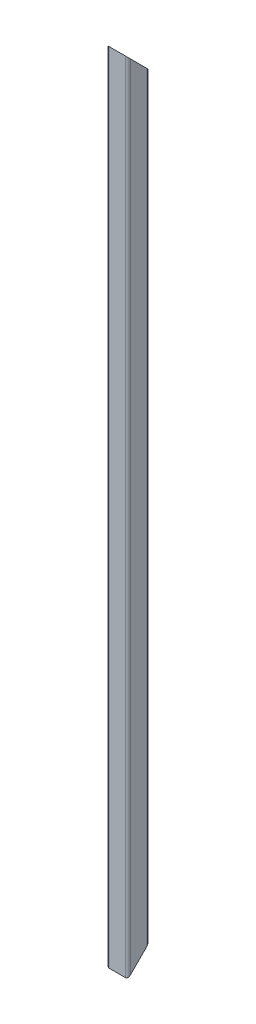
ISO-10303-21;
HEADER;
FILE_DESCRIPTION(('STEP AP214'),'2;1');
FILE_NAME('part.step','',(''),(''),'','','');
FILE_SCHEMA(('AUTOMOTIVE_DESIGN { 1 0 10303 214 1 1 1 1 }'));
ENDSEC;
DATA;
#1=APPLICATION_CONTEXT('core data for automotive mechanical design processes');
#2=APPLICATION_PROTOCOL_DEFINITION('international standard','automotive_design',2000,#1);
#3=PRODUCT_CONTEXT('',#1,'mechanical');
#4=PRODUCT('Part','Part','',(#3));
#5=PRODUCT_RELATED_PRODUCT_CATEGORY('part','',(#4));
#6=PRODUCT_DEFINITION_FORMATION('','',#4);
#7=PRODUCT_DEFINITION_CONTEXT('part definition',#1,'design');
#8=PRODUCT_DEFINITION('design','',#6,#7);
#9=PRODUCT_DEFINITION_SHAPE('','',#8);
#10=(LENGTH_UNIT() NAMED_UNIT(*) SI_UNIT(.MILLI.,.METRE.));
#11=(NAMED_UNIT(*) PLANE_ANGLE_UNIT() SI_UNIT($,.RADIAN.));
#12=(NAMED_UNIT(*) SI_UNIT($,.STERADIAN.) SOLID_ANGLE_UNIT());
#13=UNCERTAINTY_MEASURE_WITH_UNIT(LENGTH_MEASURE(1.E-05),#10,'distance_accuracy_value','');
#14=(GEOMETRIC_REPRESENTATION_CONTEXT(3) GLOBAL_UNCERTAINTY_ASSIGNED_CONTEXT((#13)) GLOBAL_UNIT_ASSIGNED_CONTEXT((#10,
#11,#12)) REPRESENTATION_CONTEXT('',''));
#15=CARTESIAN_POINT('',(0.,0.,0.));
#16=DIRECTION('',(0.,0.,1.));
#17=DIRECTION('',(1.,0.,0.));
#18=AXIS2_PLACEMENT_3D('',#15,#16,#17);
#19=CARTESIAN_POINT('',(-15.5000000000005,1460.,-20.0000000000038));
#20=DIRECTION('',(0.,0.,0.999999999999995));
#21=DIRECTION('',(0.999999999999986,0.,0.));
#22=AXIS2_PLACEMENT_3D('',#19,#20,#21);
#23=PLANE('',#22);
#24=DIRECTION('',(0.999999999999986,0.,0.));
#25=VECTOR('',#24,1.);
#26=CARTESIAN_POINT('',(-15.4999999999985,20.0000000000002,-20.0000000000025));
#27=LINE('',#26,#25);
#28=CARTESIAN_POINT('',(-15.4999999999985,20.0000000000002,-20.0000000000025));
#29=VERTEX_POINT('',#28);
#30=CARTESIAN_POINT('',(15.5000000000012,19.9999999999982,-20.0000000000026));
#31=VERTEX_POINT('',#30);
#32=EDGE_CURVE('E269',#29,#31,#27,.T.);
#33=ORIENTED_EDGE('',*,*,#32,.F.);
#34=DIRECTION('',(0.,-0.999999999999997,0.));
#35=VECTOR('',#34,1.);
#36=CARTESIAN_POINT('',(-15.5000000000005,1460.,-20.0000000000038));
#37=LINE('',#36,#35);
#38=CARTESIAN_POINT('',(-15.4999999999981,1440.,-20.0000000000026));
#39=VERTEX_POINT('',#38);
#40=EDGE_CURVE('E233',#39,#29,#37,.T.);
#41=ORIENTED_EDGE('',*,*,#40,.F.);
#42=DIRECTION('',(-0.999999999999986,0.,0.));
#43=VECTOR('',#42,1.);
#44=CARTESIAN_POINT('',(-15.4999999999981,1440.,-20.0000000000026));
#45=LINE('',#44,#43);
#46=CARTESIAN_POINT('',(15.5000000000012,1439.99999999999,-20.0000000000001));
#47=VERTEX_POINT('',#46);
#48=EDGE_CURVE('E333',#47,#39,#45,.T.);
#49=ORIENTED_EDGE('',*,*,#48,.F.);
#50=DIRECTION('',(0.,-0.999999999999997,0.));
#51=VECTOR('',#50,1.);
#52=CARTESIAN_POINT('',(15.4999999999996,1459.99999999999,-20.0000000000016));
#53=LINE('',#52,#51);
#54=EDGE_CURVE('E236',#47,#31,#53,.T.);
#55=ORIENTED_EDGE('',*,*,#54,.T.);
#56=EDGE_LOOP('',(#33,#41,#49,#55));
#57=FACE_BOUND('',#56,.T.);
#58=ADVANCED_FACE('F47',(#57),#23,.F.);
#59=CARTESIAN_POINT('',(-2.22044604925031E-13,1459.99999999999,-2.60902410786912E-12));
#60=DIRECTION('',(0.,0.707106781186544,-0.707106781186545));
#61=DIRECTION('',(0.,0.707106781186544,0.707106781186544));
#62=AXIS2_PLACEMENT_3D('',#59,#60,#61);
#63=PLANE('',#62);
#64=CARTESIAN_POINT('',(-14.9999999999966,1444.99999999999,-15.0000000000016));
#65=DIRECTION('',(0.,0.707106781186544,-0.707106781186545));
#66=DIRECTION('',(0.,-0.707106781186544,-0.707106781186544));
#67=AXIS2_PLACEMENT_3D('',#64,#65,#66);
#68=ELLIPSE('',#67,4.24264068711928,3.);
#69=CARTESIAN_POINT('',(-14.9999999999986,1441.99999999999,-18.0000000000016));
#70=VERTEX_POINT('',#69);
#71=CARTESIAN_POINT('',(-17.9999999999985,1444.99999999999,-15.000000000002));
#72=VERTEX_POINT('',#71);
#73=EDGE_CURVE('E196',#70,#72,#68,.T.);
#74=ORIENTED_EDGE('',*,*,#73,.F.);
#75=DIRECTION('',(-0.999999999999986,0.,0.));
#76=VECTOR('',#75,1.);
#77=CARTESIAN_POINT('',(-14.9999999999986,1441.99999999999,-18.0000000000016));
#78=LINE('',#77,#76);
#79=CARTESIAN_POINT('',(15.000000000001,1441.99999999999,-18.0000000000009));
#80=VERTEX_POINT('',#79);
#81=EDGE_CURVE('E327',#80,#70,#78,.T.);
#82=ORIENTED_EDGE('',*,*,#81,.F.);
#83=CARTESIAN_POINT('',(15.0000000000028,1444.99999999999,-15.0000000000025));
#84=DIRECTION('',(0.,0.707106781186544,-0.707106781186545));
#85=DIRECTION('',(0.,-0.707106781186544,-0.707106781186544));
#86=AXIS2_PLACEMENT_3D('',#83,#84,#85);
#87=ELLIPSE('',#86,4.24264068711928,3.);
#88=CARTESIAN_POINT('',(18.0000000000037,1444.99999999999,-15.0000000000031));
#89=VERTEX_POINT('',#88);
#90=EDGE_CURVE('E323',#89,#80,#87,.T.);
#91=ORIENTED_EDGE('',*,*,#90,.F.);
#92=DIRECTION('',(0.,-0.707106781186544,-0.707106781186544));
#93=VECTOR('',#92,1.);
#94=CARTESIAN_POINT('',(18.0000000000025,1452.49999999999,-7.50000000000267));
#95=LINE('',#94,#93);
#96=CARTESIAN_POINT('',(18.,1474.99999999999,14.9999999999971));
#97=VERTEX_POINT('',#96);
#98=EDGE_CURVE('E319',#97,#89,#95,.T.);
#99=ORIENTED_EDGE('',*,*,#98,.F.);
#100=CARTESIAN_POINT('',(15.0000000000015,1474.99999999999,14.9999999999973));
#101=DIRECTION('',(0.,0.707106781186544,-0.707106781186545));
#102=DIRECTION('',(0.,-0.707106781186544,-0.707106781186544));
#103=AXIS2_PLACEMENT_3D('',#100,#101,#102);
#104=ELLIPSE('',#103,4.24264068711928,3.);
#105=CARTESIAN_POINT('',(14.999999999999,1477.99999999999,17.9999999999985));
#106=VERTEX_POINT('',#105);
#107=EDGE_CURVE('E315',#106,#97,#104,.T.);
#108=ORIENTED_EDGE('',*,*,#107,.F.);
#109=DIRECTION('',(0.999999999999986,0.,0.));
#110=VECTOR('',#109,1.);
#111=CARTESIAN_POINT('',(-14.9999999999984,1477.99999999999,17.9999999999977));
#112=LINE('',#111,#110);
#113=CARTESIAN_POINT('',(-14.9999999999984,1477.99999999999,17.9999999999977));
#114=VERTEX_POINT('',#113);
#115=EDGE_CURVE('E265',#114,#106,#112,.T.);
#116=ORIENTED_EDGE('',*,*,#115,.F.);
#117=CARTESIAN_POINT('',(-14.999999999999,1474.99999999999,14.9999999999992));
#118=DIRECTION('',(0.,0.707106781186544,-0.707106781186545));
#119=DIRECTION('',(0.,-0.707106781186544,-0.707106781186544));
#120=AXIS2_PLACEMENT_3D('',#117,#118,#119);
#121=ELLIPSE('',#120,4.24264068711928,3.);
#122=CARTESIAN_POINT('',(-17.9999999999973,1474.99999999999,14.9999999999968));
#123=VERTEX_POINT('',#122);
#124=EDGE_CURVE('E263',#123,#114,#121,.T.);
#125=ORIENTED_EDGE('',*,*,#124,.F.);
#126=DIRECTION('',(0.,0.707106781186544,0.707106781186544));
#127=VECTOR('',#126,1.);
#128=CARTESIAN_POINT('',(-17.9999999999977,1452.49999999999,-7.50000000000245));
#129=LINE('',#128,#127);
#130=EDGE_CURVE('E56',#72,#123,#129,.T.);
#131=ORIENTED_EDGE('',*,*,#130,.F.);
#132=EDGE_LOOP('',(#74,#82,#91,#99,#108,#116,#125,#131));
#133=FACE_BOUND('',#132,.T.);
#134=ORIENTED_EDGE('',*,*,#48,.T.);
#135=CARTESIAN_POINT('',(-15.4999999999965,1444.5,-15.5000000000037));
#136=DIRECTION('',(0.,0.707106781186544,-0.707106781186545));
#137=DIRECTION('',(0.,-0.707106781186544,-0.707106781186544));
#138=AXIS2_PLACEMENT_3D('',#135,#136,#137);
#139=ELLIPSE('',#138,6.36396103067893,4.5);
#140=CARTESIAN_POINT('',(-19.9999999999978,1444.5,-15.5000000000011));
#141=VERTEX_POINT('',#140);
#142=EDGE_CURVE('E208',#39,#141,#139,.T.);
#143=ORIENTED_EDGE('',*,*,#142,.T.);
#144=DIRECTION('',(0.,0.707106781186544,0.707106781186544));
#145=VECTOR('',#144,1.);
#146=CARTESIAN_POINT('',(-19.9999999999987,1452.24999999999,-7.75000000000353));
#147=LINE('',#146,#145);
#148=CARTESIAN_POINT('',(-19.9999999999994,1475.49999999999,15.5000000000001));
#149=VERTEX_POINT('',#148);
#150=EDGE_CURVE('E356',#141,#149,#147,.T.);
#151=ORIENTED_EDGE('',*,*,#150,.T.);
#152=CARTESIAN_POINT('',(-15.5000000000005,1475.49999999999,15.4999999999985));
#153=DIRECTION('',(0.,0.707106781186544,-0.707106781186545));
#154=DIRECTION('',(0.,-0.707106781186544,-0.707106781186544));
#155=AXIS2_PLACEMENT_3D('',#152,#153,#154);
#156=ELLIPSE('',#155,6.36396103067893,4.5);
#157=CARTESIAN_POINT('',(-15.5000000000014,1479.99999999999,19.9999999999972));
#158=VERTEX_POINT('',#157);
#159=EDGE_CURVE('E353',#149,#158,#156,.T.);
#160=ORIENTED_EDGE('',*,*,#159,.T.);
#161=DIRECTION('',(0.999999999999986,0.,0.));
#162=VECTOR('',#161,1.);
#163=CARTESIAN_POINT('',(-15.5000000000014,1479.99999999999,19.9999999999972));
#164=LINE('',#163,#162);
#165=CARTESIAN_POINT('',(15.5000000000009,1479.99999999999,19.9999999999975));
#166=VERTEX_POINT('',#165);
#167=EDGE_CURVE('E349',#158,#166,#164,.T.);
#168=ORIENTED_EDGE('',*,*,#167,.T.);
#169=CARTESIAN_POINT('',(15.4999999999987,1475.49999999999,15.4999999999978));
#170=DIRECTION('',(0.,0.707106781186544,-0.707106781186545));
#171=DIRECTION('',(0.,-0.707106781186544,-0.707106781186544));
#172=AXIS2_PLACEMENT_3D('',#169,#170,#171);
#173=ELLIPSE('',#172,6.36396103067893,4.5);
#174=CARTESIAN_POINT('',(19.9999999999985,1475.49999999999,15.4999999999988));
#175=VERTEX_POINT('',#174);
#176=EDGE_CURVE('E345',#166,#175,#173,.T.);
#177=ORIENTED_EDGE('',*,*,#176,.T.);
#178=DIRECTION('',(0.,-0.707106781186544,-0.707106781186544));
#179=VECTOR('',#178,1.);
#180=CARTESIAN_POINT('',(20.0000000000013,1452.24999999999,-7.75000000000342));
#181=LINE('',#180,#179);
#182=CARTESIAN_POINT('',(20.0000000000022,1444.49999999999,-15.5000000000033));
#183=VERTEX_POINT('',#182);
#184=EDGE_CURVE('E341',#175,#183,#181,.T.);
#185=ORIENTED_EDGE('',*,*,#184,.T.);
#186=CARTESIAN_POINT('',(15.500000000003,1444.49999999999,-15.5000000000024));
#187=DIRECTION('',(0.,0.707106781186544,-0.707106781186545));
#188=DIRECTION('',(0.,-0.707106781186544,-0.707106781186544));
#189=AXIS2_PLACEMENT_3D('',#186,#187,#188);
#190=ELLIPSE('',#189,6.36396103067893,4.5);
#191=EDGE_CURVE('E337',#183,#47,#190,.T.);
#192=ORIENTED_EDGE('',*,*,#191,.T.);
#193=EDGE_LOOP('',(#134,#143,#151,#160,#168,#177,#185,#192));
#194=FACE_BOUND('',#193,.T.);
#195=ADVANCED_FACE('F260',(#133,#194),#63,.T.);
#196=CARTESIAN_POINT('',(-20.0000000000012,1460.,-15.5000000000036));
#197=DIRECTION('',(0.999999999999986,0.,0.));
#198=DIRECTION('',(0.,0.,-0.999999999999995));
#199=AXIS2_PLACEMENT_3D('',#196,#197,#198);
#200=PLANE('',#199);
#201=DIRECTION('',(0.,0.707106781186544,-0.707106781186545));
#202=VECTOR('',#201,1.);
#203=CARTESIAN_POINT('',(-19.9999999999983,737.749999999997,-737.749999999998));
#204=LINE('',#203,#202);
#205=CARTESIAN_POINT('',(-19.9999999999983,-15.4999999999982,15.4999999999989));
#206=VERTEX_POINT('',#205);
#207=CARTESIAN_POINT('',(-19.9999999999987,15.5000000000015,-15.5000000000027));
#208=VERTEX_POINT('',#207);
#209=EDGE_CURVE('E286',#206,#208,#204,.T.);
#210=ORIENTED_EDGE('',*,*,#209,.F.);
#211=DIRECTION('',(0.,-0.999999999999997,0.));
#212=VECTOR('',#211,1.);
#213=CARTESIAN_POINT('',(-20.0000000000003,1459.99999999999,15.4999999999961));
#214=LINE('',#213,#212);
#215=EDGE_CURVE('E205',#149,#206,#214,.T.);
#216=ORIENTED_EDGE('',*,*,#215,.F.);
#217=ORIENTED_EDGE('',*,*,#150,.F.);
#218=DIRECTION('',(0.,-0.999999999999997,0.));
#219=VECTOR('',#218,1.);
#220=CARTESIAN_POINT('',(-20.0000000000012,1460.,-15.5000000000036));
#221=LINE('',#220,#219);
#222=EDGE_CURVE('E66',#141,#208,#221,.T.);
#223=ORIENTED_EDGE('',*,*,#222,.T.);
#224=EDGE_LOOP('',(#210,#216,#217,#223));
#225=FACE_BOUND('',#224,.T.);
#226=ADVANCED_FACE('F368',(#225),#200,.F.);
#227=CARTESIAN_POINT('',(-15.5000000000003,1459.99999999999,15.4999999999961));
#228=DIRECTION('',(0.,-0.999999999999997,0.));
#229=DIRECTION('',(0.,0.,-0.999999999999995));
#230=AXIS2_PLACEMENT_3D('',#227,#228,#229);
#231=CYLINDRICAL_SURFACE('',#230,4.5);
#232=CARTESIAN_POINT('',(-15.5000000000003,-15.4999999999986,15.499999999997));
#233=DIRECTION('',(0.,-0.707106781186544,-0.707106781186545));
#234=DIRECTION('',(0.,-0.707106781186544,0.707106781186545));
#235=AXIS2_PLACEMENT_3D('',#232,#233,#234);
#236=ELLIPSE('',#235,6.36396103067893,4.5);
#237=CARTESIAN_POINT('',(-15.5000000000003,-20.,19.9999999999962));
#238=VERTEX_POINT('',#237);
#239=EDGE_CURVE('E290',#238,#206,#236,.T.);
#240=ORIENTED_EDGE('',*,*,#239,.F.);
#241=DIRECTION('',(0.,-0.999999999999997,0.));
#242=VECTOR('',#241,1.);
#243=CARTESIAN_POINT('',(-15.5000000000003,1459.99999999999,19.9999999999959));
#244=LINE('',#243,#242);
#245=EDGE_CURVE('E251',#158,#238,#244,.T.);
#246=ORIENTED_EDGE('',*,*,#245,.F.);
#247=ORIENTED_EDGE('',*,*,#159,.F.);
#248=ORIENTED_EDGE('',*,*,#215,.T.);
#249=EDGE_LOOP('',(#240,#246,#247,#248));
#250=FACE_BOUND('',#249,.T.);
#251=ADVANCED_FACE('F370',(#250),#231,.T.);
#252=CARTESIAN_POINT('',(-15.5000000000003,1459.99999999999,19.9999999999959));
#253=DIRECTION('',(0.,0.,-0.999999999999995));
#254=DIRECTION('',(-0.999999999999986,0.,0.));
#255=AXIS2_PLACEMENT_3D('',#252,#253,#254);
#256=PLANE('',#255);
#257=DIRECTION('',(-0.999999999999986,0.,0.));
#258=VECTOR('',#257,1.);
#259=CARTESIAN_POINT('',(-15.5000000000003,-20.,19.9999999999962));
#260=LINE('',#259,#258);
#261=CARTESIAN_POINT('',(15.5000000000003,-20.0000000000002,19.9999999999961));
#262=VERTEX_POINT('',#261);
#263=EDGE_CURVE('E294',#262,#238,#260,.T.);
#264=ORIENTED_EDGE('',*,*,#263,.F.);
#265=DIRECTION('',(0.,-0.999999999999997,0.));
#266=VECTOR('',#265,1.);
#267=CARTESIAN_POINT('',(15.4999999999996,1459.99999999999,19.9999999999965));
#268=LINE('',#267,#266);
#269=EDGE_CURVE('E247',#166,#262,#268,.T.);
#270=ORIENTED_EDGE('',*,*,#269,.F.);
#271=ORIENTED_EDGE('',*,*,#167,.F.);
#272=ORIENTED_EDGE('',*,*,#245,.T.);
#273=EDGE_LOOP('',(#264,#270,#271,#272));
#274=FACE_BOUND('',#273,.T.);
#275=ADVANCED_FACE('F374',(#274),#256,.F.);
#276=CARTESIAN_POINT('',(15.4999999999978,1459.99999999999,15.4999999999949));
#277=DIRECTION('',(0.,-0.999999999999997,0.));
#278=DIRECTION('',(0.,0.,-0.999999999999995));
#279=AXIS2_PLACEMENT_3D('',#276,#277,#278);
#280=CYLINDRICAL_SURFACE('',#279,4.5);
#281=CARTESIAN_POINT('',(15.5,-15.5000000000017,15.4999999999981));
#282=DIRECTION('',(0.,-0.707106781186544,-0.707106781186545));
#283=DIRECTION('',(0.,-0.707106781186544,0.707106781186545));
#284=AXIS2_PLACEMENT_3D('',#281,#282,#283);
#285=ELLIPSE('',#284,6.36396103067893,4.5);
#286=CARTESIAN_POINT('',(20.,-15.5000000000017,15.4999999999983));
#287=VERTEX_POINT('',#286);
#288=EDGE_CURVE('E298',#287,#262,#285,.T.);
#289=ORIENTED_EDGE('',*,*,#288,.F.);
#290=DIRECTION('',(0.,-0.999999999999997,0.));
#291=VECTOR('',#290,1.);
#292=CARTESIAN_POINT('',(19.9999999999986,1459.99999999999,15.499999999998));
#293=LINE('',#292,#291);
#294=EDGE_CURVE('E243',#175,#287,#293,.T.);
#295=ORIENTED_EDGE('',*,*,#294,.F.);
#296=ORIENTED_EDGE('',*,*,#176,.F.);
#297=ORIENTED_EDGE('',*,*,#269,.T.);
#298=EDGE_LOOP('',(#289,#295,#296,#297));
#299=FACE_BOUND('',#298,.T.);
#300=ADVANCED_FACE('F376',(#299),#280,.T.);
#301=CARTESIAN_POINT('',(20.,1459.99999999999,-15.5000000000031));
#302=DIRECTION('',(-0.999999999999986,0.,0.));
#303=DIRECTION('',(0.,0.,0.999999999999995));
#304=AXIS2_PLACEMENT_3D('',#301,#302,#303);
#305=PLANE('',#304);
#306=DIRECTION('',(0.,-0.707106781186544,0.707106781186545));
#307=VECTOR('',#306,1.);
#308=CARTESIAN_POINT('',(20.0000000000017,737.749999999997,-737.75));
#309=LINE('',#308,#307);
#310=CARTESIAN_POINT('',(20.0000000000018,15.4999999999986,-15.500000000003));
#311=VERTEX_POINT('',#310);
#312=EDGE_CURVE('E302',#311,#287,#309,.T.);
#313=ORIENTED_EDGE('',*,*,#312,.F.);
#314=DIRECTION('',(0.,-0.999999999999997,0.));
#315=VECTOR('',#314,1.);
#316=CARTESIAN_POINT('',(20.,1459.99999999999,-15.5000000000031));
#317=LINE('',#316,#315);
#318=EDGE_CURVE('E239',#183,#311,#317,.T.);
#319=ORIENTED_EDGE('',*,*,#318,.F.);
#320=ORIENTED_EDGE('',*,*,#184,.F.);
#321=ORIENTED_EDGE('',*,*,#294,.T.);
#322=EDGE_LOOP('',(#313,#319,#320,#321));
#323=FACE_BOUND('',#322,.T.);
#324=ADVANCED_FACE('F381',(#323),#305,.F.);
#325=CARTESIAN_POINT('',(15.4999999999994,1459.99999999999,-15.5000000000033));
#326=DIRECTION('',(0.,-0.999999999999997,0.));
#327=DIRECTION('',(0.,0.,-0.999999999999995));
#328=AXIS2_PLACEMENT_3D('',#325,#326,#327);
#329=CYLINDRICAL_SURFACE('',#328,4.5);
#330=CARTESIAN_POINT('',(15.5000000000007,15.4999999999984,-15.5000000000036));
#331=DIRECTION('',(0.,-0.707106781186544,-0.707106781186545));
#332=DIRECTION('',(0.,-0.707106781186544,0.707106781186545));
#333=AXIS2_PLACEMENT_3D('',#330,#331,#332);
#334=ELLIPSE('',#333,6.36396103067893,4.5);
#335=EDGE_CURVE('E306',#31,#311,#334,.T.);
#336=ORIENTED_EDGE('',*,*,#335,.F.);
#337=ORIENTED_EDGE('',*,*,#54,.F.);
#338=ORIENTED_EDGE('',*,*,#191,.F.);
#339=ORIENTED_EDGE('',*,*,#318,.T.);
#340=EDGE_LOOP('',(#336,#337,#338,#339));
#341=FACE_BOUND('',#340,.T.);
#342=ADVANCED_FACE('F383',(#341),#329,.T.);
#343=CARTESIAN_POINT('',(-15.4999999999998,1460.,-15.5000000000045));
#344=DIRECTION('',(0.,-0.999999999999997,0.));
#345=DIRECTION('',(0.,0.,-0.999999999999995));
#346=AXIS2_PLACEMENT_3D('',#343,#344,#345);
#347=CYLINDRICAL_SURFACE('',#346,4.5);
#348=CARTESIAN_POINT('',(-15.4999999999992,15.5000000000015,-15.5000000000019));
#349=DIRECTION('',(0.,-0.707106781186544,-0.707106781186545));
#350=DIRECTION('',(0.,-0.707106781186544,0.707106781186545));
#351=AXIS2_PLACEMENT_3D('',#348,#349,#350);
#352=ELLIPSE('',#351,6.36396103067893,4.5);
#353=EDGE_CURVE('E191',#208,#29,#352,.T.);
#354=ORIENTED_EDGE('',*,*,#353,.F.);
#355=ORIENTED_EDGE('',*,*,#222,.F.);
#356=ORIENTED_EDGE('',*,*,#142,.F.);
#357=ORIENTED_EDGE('',*,*,#40,.T.);
#358=EDGE_LOOP('',(#354,#355,#356,#357));
#359=FACE_BOUND('',#358,.T.);
#360=ADVANCED_FACE('F49',(#359),#347,.T.);
#361=CARTESIAN_POINT('',(-15.0000000000008,1459.99999999999,-15.0000000000045));
#362=DIRECTION('',(0.,-0.999999999999997,0.));
#363=DIRECTION('',(0.,0.,-0.999999999999995));
#364=AXIS2_PLACEMENT_3D('',#361,#362,#363);
#365=CYLINDRICAL_SURFACE('',#364,3.);
#366=DIRECTION('',(0.,-0.999999999999997,0.));
#367=VECTOR('',#366,1.);
#368=CARTESIAN_POINT('',(-18.0000000000003,1459.99999999999,-15.000000000003));
#369=LINE('',#368,#367);
#370=CARTESIAN_POINT('',(-17.9999999999993,15.0000000000001,-15.0000000000036));
#371=VERTEX_POINT('',#370);
#372=EDGE_CURVE('E186',#72,#371,#369,.T.);
#373=ORIENTED_EDGE('',*,*,#372,.T.);
#374=CARTESIAN_POINT('',(-14.9999999999997,14.9999999999995,-15.000000000002));
#375=DIRECTION('',(0.,-0.707106781186544,-0.707106781186545));
#376=DIRECTION('',(0.,-0.707106781186544,0.707106781186545));
#377=AXIS2_PLACEMENT_3D('',#374,#375,#376);
#378=ELLIPSE('',#377,4.24264068711928,3.);
#379=CARTESIAN_POINT('',(-14.9999999999997,18.000000000001,-18.0000000000015));
#380=VERTEX_POINT('',#379);
#381=EDGE_CURVE('E11',#371,#380,#378,.T.);
#382=ORIENTED_EDGE('',*,*,#381,.T.);
#383=DIRECTION('',(0.,-0.999999999999997,0.));
#384=VECTOR('',#383,1.);
#385=CARTESIAN_POINT('',(-15.0000000000003,1459.99999999999,-18.0000000000041));
#386=LINE('',#385,#384);
#387=EDGE_CURVE('E230',#70,#380,#386,.T.);
#388=ORIENTED_EDGE('',*,*,#387,.F.);
#389=ORIENTED_EDGE('',*,*,#73,.T.);
#390=EDGE_LOOP('',(#373,#382,#388,#389));
#391=FACE_BOUND('',#390,.T.);
#392=ADVANCED_FACE('F195',(#391),#365,.F.);
#393=CARTESIAN_POINT('',(-15.0000000000003,1459.99999999999,-18.0000000000041));
#394=DIRECTION('',(0.,0.,0.999999999999995));
#395=DIRECTION('',(0.999999999999986,0.,0.));
#396=AXIS2_PLACEMENT_3D('',#393,#394,#395);
#397=PLANE('',#396);
#398=ORIENTED_EDGE('',*,*,#387,.T.);
#399=DIRECTION('',(0.999999999999986,0.,0.));
#400=VECTOR('',#399,1.);
#401=CARTESIAN_POINT('',(-14.9999999999997,18.000000000001,-18.0000000000015));
#402=LINE('',#401,#400);
#403=CARTESIAN_POINT('',(14.9999999999997,18.0000000000002,-18.0000000000031));
#404=VERTEX_POINT('',#403);
#405=EDGE_CURVE('E75',#380,#404,#402,.T.);
#406=ORIENTED_EDGE('',*,*,#405,.T.);
#407=DIRECTION('',(0.,-0.999999999999997,0.));
#408=VECTOR('',#407,1.);
#409=CARTESIAN_POINT('',(14.9999999999999,1459.99999999999,-18.0000000000038));
#410=LINE('',#409,#408);
#411=EDGE_CURVE('E226',#80,#404,#410,.T.);
#412=ORIENTED_EDGE('',*,*,#411,.F.);
#413=ORIENTED_EDGE('',*,*,#81,.T.);
#414=EDGE_LOOP('',(#398,#406,#412,#413));
#415=FACE_BOUND('',#414,.T.);
#416=ADVANCED_FACE('F420',(#415),#397,.T.);
#417=CARTESIAN_POINT('',(15.0000000000001,1459.99999999999,-15.0000000000025));
#418=DIRECTION('',(0.,-0.999999999999997,0.));
#419=DIRECTION('',(0.,0.,-0.999999999999995));
#420=AXIS2_PLACEMENT_3D('',#417,#418,#419);
#421=CYLINDRICAL_SURFACE('',#420,3.);
#422=ORIENTED_EDGE('',*,*,#411,.T.);
#423=CARTESIAN_POINT('',(15.0000000000012,14.9999999999989,-15.000000000002));
#424=DIRECTION('',(0.,-0.707106781186544,-0.707106781186545));
#425=DIRECTION('',(0.,-0.707106781186544,0.707106781186545));
#426=AXIS2_PLACEMENT_3D('',#423,#424,#425);
#427=ELLIPSE('',#426,4.24264068711928,3.);
#428=CARTESIAN_POINT('',(18.0000000000014,14.9999999999995,-15.0000000000023));
#429=VERTEX_POINT('',#428);
#430=EDGE_CURVE('E512',#404,#429,#427,.T.);
#431=ORIENTED_EDGE('',*,*,#430,.T.);
#432=DIRECTION('',(0.,-0.999999999999997,0.));
#433=VECTOR('',#432,1.);
#434=CARTESIAN_POINT('',(17.9999999999993,1459.99999999999,-15.0000000000038));
#435=LINE('',#434,#433);
#436=EDGE_CURVE('E222',#89,#429,#435,.T.);
#437=ORIENTED_EDGE('',*,*,#436,.F.);
#438=ORIENTED_EDGE('',*,*,#90,.T.);
#439=EDGE_LOOP('',(#422,#431,#437,#438));
#440=FACE_BOUND('',#439,.T.);
#441=ADVANCED_FACE('F416',(#440),#421,.F.);
#442=CARTESIAN_POINT('',(17.9999999999993,1459.99999999999,-15.0000000000038));
#443=DIRECTION('',(-0.999999999999986,0.,0.));
#444=DIRECTION('',(0.,0.,0.999999999999995));
#445=AXIS2_PLACEMENT_3D('',#442,#443,#444);
#446=PLANE('',#445);
#447=ORIENTED_EDGE('',*,*,#436,.T.);
#448=DIRECTION('',(0.,-0.707106781186544,0.707106781186545));
#449=VECTOR('',#448,1.);
#450=CARTESIAN_POINT('',(18.0000000000002,737.499999999997,-737.499999999999));
#451=LINE('',#450,#449);
#452=CARTESIAN_POINT('',(18.0000000000007,-14.9999999999999,14.999999999996));
#453=VERTEX_POINT('',#452);
#454=EDGE_CURVE('E514',#429,#453,#451,.T.);
#455=ORIENTED_EDGE('',*,*,#454,.T.);
#456=DIRECTION('',(0.,-0.999999999999997,0.));
#457=VECTOR('',#456,1.);
#458=CARTESIAN_POINT('',(17.9999999999989,1459.99999999999,14.9999999999959));
#459=LINE('',#458,#457);
#460=EDGE_CURVE('E218',#97,#453,#459,.T.);
#461=ORIENTED_EDGE('',*,*,#460,.F.);
#462=ORIENTED_EDGE('',*,*,#98,.T.);
#463=EDGE_LOOP('',(#447,#455,#461,#462));
#464=FACE_BOUND('',#463,.T.);
#465=ADVANCED_FACE('F412',(#464),#446,.T.);
#466=CARTESIAN_POINT('',(14.9999999999995,1459.99999999999,14.9999999999974));
#467=DIRECTION('',(0.,-0.999999999999997,0.));
#468=DIRECTION('',(0.,0.,-0.999999999999995));
#469=AXIS2_PLACEMENT_3D('',#466,#467,#468);
#470=CYLINDRICAL_SURFACE('',#469,3.);
#471=ORIENTED_EDGE('',*,*,#460,.T.);
#472=CARTESIAN_POINT('',(14.9999999999997,-15.0000000000011,14.9999999999977));
#473=DIRECTION('',(0.,-0.707106781186544,-0.707106781186545));
#474=DIRECTION('',(0.,-0.707106781186544,0.707106781186545));
#475=AXIS2_PLACEMENT_3D('',#472,#473,#474);
#476=ELLIPSE('',#475,4.24264068711928,3.);
#477=CARTESIAN_POINT('',(15.0000000000001,-18.0000000000012,17.9999999999996));
#478=VERTEX_POINT('',#477);
#479=EDGE_CURVE('E279',#453,#478,#476,.T.);
#480=ORIENTED_EDGE('',*,*,#479,.T.);
#481=DIRECTION('',(0.,-0.999999999999997,0.));
#482=VECTOR('',#481,1.);
#483=CARTESIAN_POINT('',(14.9999999999992,1459.99999999999,17.9999999999975));
#484=LINE('',#483,#482);
#485=EDGE_CURVE('E214',#106,#478,#484,.T.);
#486=ORIENTED_EDGE('',*,*,#485,.F.);
#487=ORIENTED_EDGE('',*,*,#107,.T.);
#488=EDGE_LOOP('',(#471,#480,#486,#487));
#489=FACE_BOUND('',#488,.T.);
#490=ADVANCED_FACE('F408',(#489),#470,.F.);
#491=CARTESIAN_POINT('',(-15.000000000001,1459.99999999999,17.999999999998));
#492=DIRECTION('',(0.,0.,-0.999999999999995));
#493=DIRECTION('',(-0.999999999999986,0.,0.));
#494=AXIS2_PLACEMENT_3D('',#491,#492,#493);
#495=PLANE('',#494);
#496=ORIENTED_EDGE('',*,*,#485,.T.);
#497=DIRECTION('',(-0.999999999999986,0.,0.));
#498=VECTOR('',#497,1.);
#499=CARTESIAN_POINT('',(-14.9999999999997,-17.9999999999998,17.9999999999975));
#500=LINE('',#499,#498);
#501=CARTESIAN_POINT('',(-14.9999999999997,-17.9999999999998,17.9999999999975));
#502=VERTEX_POINT('',#501);
#503=EDGE_CURVE('E274',#478,#502,#500,.T.);
#504=ORIENTED_EDGE('',*,*,#503,.T.);
#505=DIRECTION('',(0.,-0.999999999999997,0.));
#506=VECTOR('',#505,1.);
#507=CARTESIAN_POINT('',(-15.000000000001,1459.99999999999,17.999999999998));
#508=LINE('',#507,#506);
#509=EDGE_CURVE('E203',#114,#502,#508,.T.);
#510=ORIENTED_EDGE('',*,*,#509,.F.);
#511=ORIENTED_EDGE('',*,*,#115,.T.);
#512=EDGE_LOOP('',(#496,#504,#510,#511));
#513=FACE_BOUND('',#512,.T.);
#514=ADVANCED_FACE('F405',(#513),#495,.T.);
#515=CARTESIAN_POINT('',(-15.0000000000003,1459.99999999999,14.999999999997));
#516=DIRECTION('',(0.,-0.999999999999997,0.));
#517=DIRECTION('',(0.,0.,-0.999999999999995));
#518=AXIS2_PLACEMENT_3D('',#515,#516,#517);
#519=CYLINDRICAL_SURFACE('',#518,3.);
#520=ORIENTED_EDGE('',*,*,#509,.T.);
#521=CARTESIAN_POINT('',(-14.9999999999997,-14.9999999999997,14.9999999999975));
#522=DIRECTION('',(0.,-0.707106781186544,-0.707106781186545));
#523=DIRECTION('',(0.,-0.707106781186544,0.707106781186545));
#524=AXIS2_PLACEMENT_3D('',#521,#522,#523);
#525=ELLIPSE('',#524,4.24264068711928,3.);
#526=CARTESIAN_POINT('',(-17.9999999999997,-14.9999999999997,14.9999999999981));
#527=VERTEX_POINT('',#526);
#528=EDGE_CURVE('E192',#502,#527,#525,.T.);
#529=ORIENTED_EDGE('',*,*,#528,.T.);
#530=DIRECTION('',(0.,-0.999999999999997,0.));
#531=VECTOR('',#530,1.);
#532=CARTESIAN_POINT('',(-17.9999999999998,1459.99999999999,14.9999999999973));
#533=LINE('',#532,#531);
#534=EDGE_CURVE('E188',#123,#527,#533,.T.);
#535=ORIENTED_EDGE('',*,*,#534,.F.);
#536=ORIENTED_EDGE('',*,*,#124,.T.);
#537=EDGE_LOOP('',(#520,#529,#535,#536));
#538=FACE_BOUND('',#537,.T.);
#539=ADVANCED_FACE('F271',(#538),#519,.F.);
#540=CARTESIAN_POINT('',(-18.0000000000003,1459.99999999999,-15.000000000003));
#541=DIRECTION('',(0.999999999999986,0.,0.));
#542=DIRECTION('',(0.,0.,-0.999999999999995));
#543=AXIS2_PLACEMENT_3D('',#540,#541,#542);
#544=PLANE('',#543);
#545=ORIENTED_EDGE('',*,*,#534,.T.);
#546=DIRECTION('',(0.,0.707106781186544,-0.707106781186545));
#547=VECTOR('',#546,1.);
#548=CARTESIAN_POINT('',(-17.9999999999992,737.499999999997,-737.500000000001));
#549=LINE('',#548,#547);
#550=EDGE_CURVE('E177',#527,#371,#549,.T.);
#551=ORIENTED_EDGE('',*,*,#550,.T.);
#552=ORIENTED_EDGE('',*,*,#372,.F.);
#553=ORIENTED_EDGE('',*,*,#130,.T.);
#554=EDGE_LOOP('',(#545,#551,#552,#553));
#555=FACE_BOUND('',#554,.T.);
#556=ADVANCED_FACE('F184',(#555),#544,.T.);
#557=CARTESIAN_POINT('',(0.,0.,0.));
#558=DIRECTION('',(0.,-0.707106781186544,-0.707106781186545));
#559=DIRECTION('',(0.,0.707106781186544,-0.707106781186545));
#560=AXIS2_PLACEMENT_3D('',#557,#558,#559);
#561=PLANE('',#560);
#562=ORIENTED_EDGE('',*,*,#550,.F.);
#563=ORIENTED_EDGE('',*,*,#528,.F.);
#564=ORIENTED_EDGE('',*,*,#503,.F.);
#565=ORIENTED_EDGE('',*,*,#479,.F.);
#566=ORIENTED_EDGE('',*,*,#454,.F.);
#567=ORIENTED_EDGE('',*,*,#430,.F.);
#568=ORIENTED_EDGE('',*,*,#405,.F.);
#569=ORIENTED_EDGE('',*,*,#381,.F.);
#570=EDGE_LOOP('',(#562,#563,#564,#565,#566,#567,#568,#569));
#571=FACE_BOUND('',#570,.T.);
#572=ORIENTED_EDGE('',*,*,#353,.T.);
#573=ORIENTED_EDGE('',*,*,#32,.T.);
#574=ORIENTED_EDGE('',*,*,#335,.T.);
#575=ORIENTED_EDGE('',*,*,#312,.T.);
#576=ORIENTED_EDGE('',*,*,#288,.T.);
#577=ORIENTED_EDGE('',*,*,#263,.T.);
#578=ORIENTED_EDGE('',*,*,#239,.T.);
#579=ORIENTED_EDGE('',*,*,#209,.T.);
#580=EDGE_LOOP('',(#572,#573,#574,#575,#576,#577,#578,#579));
#581=FACE_BOUND('',#580,.T.);
#582=ADVANCED_FACE('F175',(#571,#581),#561,.T.);
#583=CLOSED_SHELL('',(#58,#195,#226,#251,#275,#300,#324,#342,#360,#392,#416,#441,#465,#490,#514,
#539,#556,#582));
#584=MANIFOLD_SOLID_BREP('B2',#583);
#585=ADVANCED_BREP_SHAPE_REPRESENTATION('',(#18,#584),#14);
#586=SHAPE_DEFINITION_REPRESENTATION(#9,#585);
ENDSEC;
END-ISO-10303-21;
